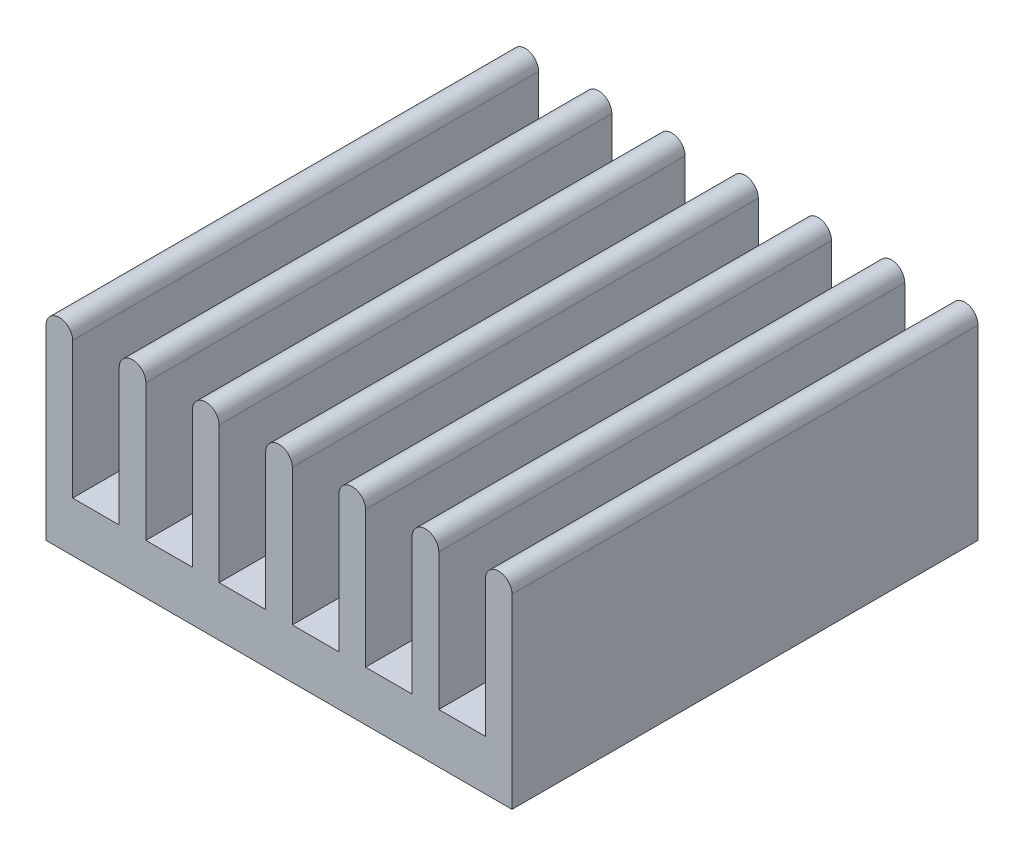
ISO-10303-21;
HEADER;
FILE_DESCRIPTION(('STEP AP214'),'2;1');
FILE_NAME('part.step','',(''),(''),'','','');
FILE_SCHEMA(('AUTOMOTIVE_DESIGN { 1 0 10303 214 1 1 1 1 }'));
ENDSEC;
DATA;
#1=APPLICATION_CONTEXT('core data for automotive mechanical design processes');
#2=APPLICATION_PROTOCOL_DEFINITION('international standard','automotive_design',2000,#1);
#3=PRODUCT_CONTEXT('',#1,'mechanical');
#4=PRODUCT('Part','Part','',(#3));
#5=PRODUCT_RELATED_PRODUCT_CATEGORY('part','',(#4));
#6=PRODUCT_DEFINITION_FORMATION('','',#4);
#7=PRODUCT_DEFINITION_CONTEXT('part definition',#1,'design');
#8=PRODUCT_DEFINITION('design','',#6,#7);
#9=PRODUCT_DEFINITION_SHAPE('','',#8);
#10=(LENGTH_UNIT() NAMED_UNIT(*) SI_UNIT(.MILLI.,.METRE.));
#11=(NAMED_UNIT(*) PLANE_ANGLE_UNIT() SI_UNIT($,.RADIAN.));
#12=(NAMED_UNIT(*) SI_UNIT($,.STERADIAN.) SOLID_ANGLE_UNIT());
#13=UNCERTAINTY_MEASURE_WITH_UNIT(LENGTH_MEASURE(1.E-05),#10,'distance_accuracy_value','');
#14=(GEOMETRIC_REPRESENTATION_CONTEXT(3) GLOBAL_UNCERTAINTY_ASSIGNED_CONTEXT((#13)) GLOBAL_UNIT_ASSIGNED_CONTEXT((#10,
#11,#12)) REPRESENTATION_CONTEXT('',''));
#15=CARTESIAN_POINT('',(0.,0.,0.));
#16=DIRECTION('',(0.,0.,1.));
#17=DIRECTION('',(1.,0.,0.));
#18=AXIS2_PLACEMENT_3D('',#15,#16,#17);
#19=CARTESIAN_POINT('',(-22.4999999999967,-6.44999999998326,3.25));
#20=DIRECTION('',(0.,-1.,0.));
#21=DIRECTION('',(-1.,0.,0.));
#22=AXIS2_PLACEMENT_3D('',#19,#20,#21);
#23=PLANE('',#22);
#24=DIRECTION('',(1.,0.,0.));
#25=VECTOR('',#24,1.);
#26=CARTESIAN_POINT('',(-22.4999999999967,-6.44999999998326,-3.75));
#27=LINE('',#26,#25);
#28=CARTESIAN_POINT('',(-22.4999999999967,-6.44999999998326,-3.75));
#29=VERTEX_POINT('',#28);
#30=CARTESIAN_POINT('',(-8.49999999999675,-6.44999999998326,-3.75));
#31=VERTEX_POINT('',#30);
#32=EDGE_CURVE('E11',#29,#31,#27,.T.);
#33=ORIENTED_EDGE('',*,*,#32,.T.);
#34=DIRECTION('',(0.,0.,-1.));
#35=VECTOR('',#34,1.);
#36=CARTESIAN_POINT('',(-8.49999999999675,-6.44999999998326,10.25));
#37=LINE('',#36,#35);
#38=CARTESIAN_POINT('',(-8.49999999999675,-6.44999999998326,10.25));
#39=VERTEX_POINT('',#38);
#40=EDGE_CURVE('E42',#39,#31,#37,.T.);
#41=ORIENTED_EDGE('',*,*,#40,.F.);
#42=DIRECTION('',(1.,0.,0.));
#43=VECTOR('',#42,1.);
#44=CARTESIAN_POINT('',(-22.4999999999967,-6.44999999998325,10.25));
#45=LINE('',#44,#43);
#46=CARTESIAN_POINT('',(-22.4999999999967,-6.44999999998325,10.25));
#47=VERTEX_POINT('',#46);
#48=EDGE_CURVE('E223',#47,#39,#45,.T.);
#49=ORIENTED_EDGE('',*,*,#48,.F.);
#50=DIRECTION('',(0.,0.,-1.));
#51=VECTOR('',#50,1.);
#52=CARTESIAN_POINT('',(-22.4999999999967,-6.44999999998325,10.25));
#53=LINE('',#52,#51);
#54=EDGE_CURVE('E28',#47,#29,#53,.T.);
#55=ORIENTED_EDGE('',*,*,#54,.T.);
#56=EDGE_LOOP('',(#33,#41,#49,#55));
#57=FACE_BOUND('',#56,.T.);
#58=ADVANCED_FACE('F17',(#57),#23,.T.);
#59=CARTESIAN_POINT('',(-15.4999999999967,-6.44999999998326,-3.75));
#60=DIRECTION('',(0.,0.,-1.));
#61=DIRECTION('',(0.,-1.,0.));
#62=AXIS2_PLACEMENT_3D('',#59,#60,#61);
#63=PLANE('',#62);
#64=CARTESIAN_POINT('',(-22.0999999999967,-0.849999999983262,-3.75));
#65=DIRECTION('',(0.,0.,1.));
#66=DIRECTION('',(-1.,0.,0.));
#67=AXIS2_PLACEMENT_3D('',#64,#65,#66);
#68=CIRCLE('',#67,0.4);
#69=CARTESIAN_POINT('',(-21.6999999999967,-0.849999999983261,-3.75));
#70=VERTEX_POINT('',#69);
#71=CARTESIAN_POINT('',(-22.4999999999967,-0.849999999983261,-3.75));
#72=VERTEX_POINT('',#71);
#73=EDGE_CURVE('E21',#70,#72,#68,.T.);
#74=ORIENTED_EDGE('',*,*,#73,.F.);
#75=DIRECTION('',(0.,1.,0.));
#76=VECTOR('',#75,1.);
#77=CARTESIAN_POINT('',(-21.6999999999967,-4.94999999998326,-3.75));
#78=LINE('',#77,#76);
#79=CARTESIAN_POINT('',(-21.6999999999967,-4.94999999998326,-3.75));
#80=VERTEX_POINT('',#79);
#81=EDGE_CURVE('E430',#80,#70,#78,.T.);
#82=ORIENTED_EDGE('',*,*,#81,.F.);
#83=DIRECTION('',(-1.,0.,0.));
#84=VECTOR('',#83,1.);
#85=CARTESIAN_POINT('',(-20.2999999999967,-4.94999999998325,-3.75));
#86=LINE('',#85,#84);
#87=CARTESIAN_POINT('',(-20.2999999999967,-4.94999999998324,-3.75));
#88=VERTEX_POINT('',#87);
#89=EDGE_CURVE('E494',#88,#80,#86,.T.);
#90=ORIENTED_EDGE('',*,*,#89,.F.);
#91=DIRECTION('',(0.,-1.,0.));
#92=VECTOR('',#91,1.);
#93=CARTESIAN_POINT('',(-20.2999999999967,-0.849999999983261,-3.75));
#94=LINE('',#93,#92);
#95=CARTESIAN_POINT('',(-20.2999999999967,-0.849999999983261,-3.75));
#96=VERTEX_POINT('',#95);
#97=EDGE_CURVE('E347',#96,#88,#94,.T.);
#98=ORIENTED_EDGE('',*,*,#97,.F.);
#99=CARTESIAN_POINT('',(-19.8999999999967,-0.849999999983264,-3.75));
#100=DIRECTION('',(0.,0.,1.));
#101=DIRECTION('',(-1.,0.,0.));
#102=AXIS2_PLACEMENT_3D('',#99,#100,#101);
#103=CIRCLE('',#102,0.4);
#104=CARTESIAN_POINT('',(-19.4999999999967,-0.849999999983261,-3.75));
#105=VERTEX_POINT('',#104);
#106=EDGE_CURVE('E346',#105,#96,#103,.T.);
#107=ORIENTED_EDGE('',*,*,#106,.F.);
#108=DIRECTION('',(0.,1.,0.));
#109=VECTOR('',#108,1.);
#110=CARTESIAN_POINT('',(-19.4999999999967,-4.94999999998326,-3.75));
#111=LINE('',#110,#109);
#112=CARTESIAN_POINT('',(-19.4999999999967,-4.94999999998326,-3.75));
#113=VERTEX_POINT('',#112);
#114=EDGE_CURVE('E336',#113,#105,#111,.T.);
#115=ORIENTED_EDGE('',*,*,#114,.F.);
#116=DIRECTION('',(-1.,0.,0.));
#117=VECTOR('',#116,1.);
#118=CARTESIAN_POINT('',(-18.0999999999967,-4.94999999998327,-3.75));
#119=LINE('',#118,#117);
#120=CARTESIAN_POINT('',(-18.0999999999967,-4.94999999998327,-3.75));
#121=VERTEX_POINT('',#120);
#122=EDGE_CURVE('E335',#121,#113,#119,.T.);
#123=ORIENTED_EDGE('',*,*,#122,.F.);
#124=DIRECTION('',(0.,-1.,0.));
#125=VECTOR('',#124,1.);
#126=CARTESIAN_POINT('',(-18.0999999999967,-0.849999999983261,-3.75));
#127=LINE('',#126,#125);
#128=CARTESIAN_POINT('',(-18.0999999999967,-0.849999999983261,-3.75));
#129=VERTEX_POINT('',#128);
#130=EDGE_CURVE('E411',#129,#121,#127,.T.);
#131=ORIENTED_EDGE('',*,*,#130,.F.);
#132=CARTESIAN_POINT('',(-17.6999999999967,-0.849999999983262,-3.75));
#133=DIRECTION('',(0.,0.,1.));
#134=DIRECTION('',(-1.,0.,0.));
#135=AXIS2_PLACEMENT_3D('',#132,#133,#134);
#136=CIRCLE('',#135,0.4);
#137=CARTESIAN_POINT('',(-17.2999999999967,-0.849999999983261,-3.75));
#138=VERTEX_POINT('',#137);
#139=EDGE_CURVE('E362',#138,#129,#136,.T.);
#140=ORIENTED_EDGE('',*,*,#139,.F.);
#141=DIRECTION('',(0.,1.,0.));
#142=VECTOR('',#141,1.);
#143=CARTESIAN_POINT('',(-17.2999999999967,-4.94999999998327,-3.75));
#144=LINE('',#143,#142);
#145=CARTESIAN_POINT('',(-17.2999999999967,-4.94999999998327,-3.75));
#146=VERTEX_POINT('',#145);
#147=EDGE_CURVE('E361',#146,#138,#144,.T.);
#148=ORIENTED_EDGE('',*,*,#147,.F.);
#149=DIRECTION('',(-1.,0.,0.));
#150=VECTOR('',#149,1.);
#151=CARTESIAN_POINT('',(-15.8999999999968,-4.94999999998327,-3.75));
#152=LINE('',#151,#150);
#153=CARTESIAN_POINT('',(-15.8999999999968,-4.94999999998327,-3.75));
#154=VERTEX_POINT('',#153);
#155=EDGE_CURVE('E379',#154,#146,#152,.T.);
#156=ORIENTED_EDGE('',*,*,#155,.F.);
#157=DIRECTION('',(0.,-1.,0.));
#158=VECTOR('',#157,1.);
#159=CARTESIAN_POINT('',(-15.8999999999967,-0.849999999983261,-3.75));
#160=LINE('',#159,#158);
#161=CARTESIAN_POINT('',(-15.8999999999967,-0.849999999983261,-3.75));
#162=VERTEX_POINT('',#161);
#163=EDGE_CURVE('E474',#162,#154,#160,.T.);
#164=ORIENTED_EDGE('',*,*,#163,.F.);
#165=CARTESIAN_POINT('',(-15.4999999999967,-0.849999999983262,-3.75));
#166=DIRECTION('',(0.,0.,1.));
#167=DIRECTION('',(-1.,0.,0.));
#168=AXIS2_PLACEMENT_3D('',#165,#166,#167);
#169=CIRCLE('',#168,0.4);
#170=CARTESIAN_POINT('',(-15.0999999999967,-0.849999999983261,-3.75));
#171=VERTEX_POINT('',#170);
#172=EDGE_CURVE('E458',#171,#162,#169,.T.);
#173=ORIENTED_EDGE('',*,*,#172,.F.);
#174=DIRECTION('',(0.,1.,0.));
#175=VECTOR('',#174,1.);
#176=CARTESIAN_POINT('',(-15.0999999999967,-4.94999999998326,-3.75));
#177=LINE('',#176,#175);
#178=CARTESIAN_POINT('',(-15.0999999999967,-4.94999999998326,-3.75));
#179=VERTEX_POINT('',#178);
#180=EDGE_CURVE('E472',#179,#171,#177,.T.);
#181=ORIENTED_EDGE('',*,*,#180,.F.);
#182=DIRECTION('',(-1.,0.,0.));
#183=VECTOR('',#182,1.);
#184=CARTESIAN_POINT('',(-13.6999999999967,-4.94999999998326,-3.75));
#185=LINE('',#184,#183);
#186=CARTESIAN_POINT('',(-13.6999999999967,-4.94999999998326,-3.75));
#187=VERTEX_POINT('',#186);
#188=EDGE_CURVE('E337',#187,#179,#185,.T.);
#189=ORIENTED_EDGE('',*,*,#188,.F.);
#190=DIRECTION('',(0.,-1.,0.));
#191=VECTOR('',#190,1.);
#192=CARTESIAN_POINT('',(-13.6999999999967,-0.849999999983261,-3.75));
#193=LINE('',#192,#191);
#194=CARTESIAN_POINT('',(-13.6999999999967,-0.849999999983261,-3.75));
#195=VERTEX_POINT('',#194);
#196=EDGE_CURVE('E304',#195,#187,#193,.T.);
#197=ORIENTED_EDGE('',*,*,#196,.F.);
#198=CARTESIAN_POINT('',(-13.2999999999967,-0.849999999983262,-3.75));
#199=DIRECTION('',(0.,0.,1.));
#200=DIRECTION('',(-1.,0.,0.));
#201=AXIS2_PLACEMENT_3D('',#198,#199,#200);
#202=CIRCLE('',#201,0.4);
#203=CARTESIAN_POINT('',(-12.8999999999967,-0.849999999983261,-3.75));
#204=VERTEX_POINT('',#203);
#205=EDGE_CURVE('E402',#204,#195,#202,.T.);
#206=ORIENTED_EDGE('',*,*,#205,.F.);
#207=DIRECTION('',(0.,1.,0.));
#208=VECTOR('',#207,1.);
#209=CARTESIAN_POINT('',(-12.8999999999967,-4.94999999998326,-3.75));
#210=LINE('',#209,#208);
#211=CARTESIAN_POINT('',(-12.8999999999967,-4.94999999998326,-3.75));
#212=VERTEX_POINT('',#211);
#213=EDGE_CURVE('E259',#212,#204,#210,.T.);
#214=ORIENTED_EDGE('',*,*,#213,.F.);
#215=DIRECTION('',(-1.,0.,0.));
#216=VECTOR('',#215,1.);
#217=CARTESIAN_POINT('',(-11.4999999999967,-4.94999999998326,-3.75));
#218=LINE('',#217,#216);
#219=CARTESIAN_POINT('',(-11.4999999999967,-4.94999999998326,-3.75));
#220=VERTEX_POINT('',#219);
#221=EDGE_CURVE('E252',#220,#212,#218,.T.);
#222=ORIENTED_EDGE('',*,*,#221,.F.);
#223=DIRECTION('',(0.,-1.,0.));
#224=VECTOR('',#223,1.);
#225=CARTESIAN_POINT('',(-11.4999999999967,-0.849999999983261,-3.75));
#226=LINE('',#225,#224);
#227=CARTESIAN_POINT('',(-11.4999999999967,-0.849999999983261,-3.75));
#228=VERTEX_POINT('',#227);
#229=EDGE_CURVE('E255',#228,#220,#226,.T.);
#230=ORIENTED_EDGE('',*,*,#229,.F.);
#231=CARTESIAN_POINT('',(-11.0999999999967,-0.849999999983261,-3.75));
#232=DIRECTION('',(0.,0.,1.));
#233=DIRECTION('',(-1.,0.,0.));
#234=AXIS2_PLACEMENT_3D('',#231,#232,#233);
#235=CIRCLE('',#234,0.4);
#236=CARTESIAN_POINT('',(-10.6999999999967,-0.849999999983261,-3.75));
#237=VERTEX_POINT('',#236);
#238=EDGE_CURVE('E325',#237,#228,#235,.T.);
#239=ORIENTED_EDGE('',*,*,#238,.F.);
#240=DIRECTION('',(0.,1.,0.));
#241=VECTOR('',#240,1.);
#242=CARTESIAN_POINT('',(-10.6999999999967,-4.94999999998327,-3.75));
#243=LINE('',#242,#241);
#244=CARTESIAN_POINT('',(-10.6999999999967,-4.94999999998327,-3.75));
#245=VERTEX_POINT('',#244);
#246=EDGE_CURVE('E310',#245,#237,#243,.T.);
#247=ORIENTED_EDGE('',*,*,#246,.F.);
#248=DIRECTION('',(-1.,0.,0.));
#249=VECTOR('',#248,1.);
#250=CARTESIAN_POINT('',(-9.29999999999674,-4.94999999998326,-3.75));
#251=LINE('',#250,#249);
#252=CARTESIAN_POINT('',(-9.29999999999674,-4.94999999998326,-3.75));
#253=VERTEX_POINT('',#252);
#254=EDGE_CURVE('E529',#253,#245,#251,.T.);
#255=ORIENTED_EDGE('',*,*,#254,.F.);
#256=DIRECTION('',(0.,-1.,0.));
#257=VECTOR('',#256,1.);
#258=CARTESIAN_POINT('',(-9.29999999999675,-0.849999999983261,-3.75));
#259=LINE('',#258,#257);
#260=CARTESIAN_POINT('',(-9.29999999999675,-0.849999999983261,-3.75));
#261=VERTEX_POINT('',#260);
#262=EDGE_CURVE('E351',#261,#253,#259,.T.);
#263=ORIENTED_EDGE('',*,*,#262,.F.);
#264=CARTESIAN_POINT('',(-8.89999999999675,-0.849999999983262,-3.75));
#265=DIRECTION('',(0.,0.,1.));
#266=DIRECTION('',(-1.,0.,0.));
#267=AXIS2_PLACEMENT_3D('',#264,#265,#266);
#268=CIRCLE('',#267,0.4);
#269=CARTESIAN_POINT('',(-8.49999999999675,-0.849999999983261,-3.75));
#270=VERTEX_POINT('',#269);
#271=EDGE_CURVE('E350',#270,#261,#268,.T.);
#272=ORIENTED_EDGE('',*,*,#271,.F.);
#273=DIRECTION('',(0.,1.,0.));
#274=VECTOR('',#273,1.);
#275=CARTESIAN_POINT('',(-8.49999999999675,-6.44999999998326,-3.75));
#276=LINE('',#275,#274);
#277=EDGE_CURVE('E397',#31,#270,#276,.T.);
#278=ORIENTED_EDGE('',*,*,#277,.F.);
#279=ORIENTED_EDGE('',*,*,#32,.F.);
#280=DIRECTION('',(0.,-1.,0.));
#281=VECTOR('',#280,1.);
#282=CARTESIAN_POINT('',(-22.4999999999967,-0.849999999983261,-3.75));
#283=LINE('',#282,#281);
#284=EDGE_CURVE('E431',#72,#29,#283,.T.);
#285=ORIENTED_EDGE('',*,*,#284,.F.);
#286=EDGE_LOOP('',(#74,#82,#90,#98,#107,#115,#123,#131,#140,#148,#156,#164,#173,#181,#189,#197,
#206,#214,#222,#230,#239,#247,#255,#263,#272,#278,#279,#285));
#287=FACE_BOUND('',#286,.T.);
#288=ADVANCED_FACE('F254',(#287),#63,.T.);
#289=CARTESIAN_POINT('',(-8.89999999999675,-0.849999999983262,3.25));
#290=DIRECTION('',(0.,0.,1.));
#291=DIRECTION('',(1.,0.,0.));
#292=AXIS2_PLACEMENT_3D('',#289,#290,#291);
#293=CYLINDRICAL_SURFACE('',#292,0.4);
#294=ORIENTED_EDGE('',*,*,#271,.T.);
#295=DIRECTION('',(0.,0.,-1.));
#296=VECTOR('',#295,1.);
#297=CARTESIAN_POINT('',(-9.29999999999675,-0.849999999983265,10.25));
#298=LINE('',#297,#296);
#299=CARTESIAN_POINT('',(-9.29999999999675,-0.849999999983257,10.25));
#300=VERTEX_POINT('',#299);
#301=EDGE_CURVE('E356',#300,#261,#298,.T.);
#302=ORIENTED_EDGE('',*,*,#301,.F.);
#303=CARTESIAN_POINT('',(-8.89999999999675,-0.849999999983259,10.25));
#304=DIRECTION('',(0.,0.,1.));
#305=DIRECTION('',(-1.,0.,0.));
#306=AXIS2_PLACEMENT_3D('',#303,#304,#305);
#307=CIRCLE('',#306,0.4);
#308=CARTESIAN_POINT('',(-8.49999999999675,-0.849999999983257,10.25));
#309=VERTEX_POINT('',#308);
#310=EDGE_CURVE('E296',#309,#300,#307,.T.);
#311=ORIENTED_EDGE('',*,*,#310,.F.);
#312=DIRECTION('',(0.,0.,-1.));
#313=VECTOR('',#312,1.);
#314=CARTESIAN_POINT('',(-8.49999999999675,-0.849999999983261,10.25));
#315=LINE('',#314,#313);
#316=EDGE_CURVE('E355',#309,#270,#315,.T.);
#317=ORIENTED_EDGE('',*,*,#316,.T.);
#318=EDGE_LOOP('',(#294,#302,#311,#317));
#319=FACE_BOUND('',#318,.T.);
#320=ADVANCED_FACE('F632',(#319),#293,.T.);
#321=CARTESIAN_POINT('',(-9.29999999999675,-0.849999999983265,3.25));
#322=DIRECTION('',(-1.,0.,0.));
#323=DIRECTION('',(0.,1.,0.));
#324=AXIS2_PLACEMENT_3D('',#321,#322,#323);
#325=PLANE('',#324);
#326=ORIENTED_EDGE('',*,*,#262,.T.);
#327=DIRECTION('',(0.,0.,-1.));
#328=VECTOR('',#327,1.);
#329=CARTESIAN_POINT('',(-9.29999999999674,-4.94999999998326,10.25));
#330=LINE('',#329,#328);
#331=CARTESIAN_POINT('',(-9.29999999999674,-4.94999999998326,10.25));
#332=VERTEX_POINT('',#331);
#333=EDGE_CURVE('E314',#332,#253,#330,.T.);
#334=ORIENTED_EDGE('',*,*,#333,.F.);
#335=DIRECTION('',(0.,-1.,0.));
#336=VECTOR('',#335,1.);
#337=CARTESIAN_POINT('',(-9.29999999999675,-0.849999999983261,10.25));
#338=LINE('',#337,#336);
#339=EDGE_CURVE('E293',#300,#332,#338,.T.);
#340=ORIENTED_EDGE('',*,*,#339,.F.);
#341=ORIENTED_EDGE('',*,*,#301,.T.);
#342=EDGE_LOOP('',(#326,#334,#340,#341));
#343=FACE_BOUND('',#342,.T.);
#344=ADVANCED_FACE('F641',(#343),#325,.T.);
#345=CARTESIAN_POINT('',(-9.29999999999674,-4.94999999998326,3.25));
#346=DIRECTION('',(0.,1.,0.));
#347=DIRECTION('',(1.,0.,0.));
#348=AXIS2_PLACEMENT_3D('',#345,#346,#347);
#349=PLANE('',#348);
#350=ORIENTED_EDGE('',*,*,#254,.T.);
#351=DIRECTION('',(0.,0.,-1.));
#352=VECTOR('',#351,1.);
#353=CARTESIAN_POINT('',(-10.6999999999967,-4.94999999998327,10.25));
#354=LINE('',#353,#352);
#355=CARTESIAN_POINT('',(-10.6999999999967,-4.94999999998327,10.25));
#356=VERTEX_POINT('',#355);
#357=EDGE_CURVE('E315',#356,#245,#354,.T.);
#358=ORIENTED_EDGE('',*,*,#357,.F.);
#359=DIRECTION('',(-1.,0.,0.));
#360=VECTOR('',#359,1.);
#361=CARTESIAN_POINT('',(-9.29999999999674,-4.94999999998326,10.25));
#362=LINE('',#361,#360);
#363=EDGE_CURVE('E297',#332,#356,#362,.T.);
#364=ORIENTED_EDGE('',*,*,#363,.F.);
#365=ORIENTED_EDGE('',*,*,#333,.T.);
#366=EDGE_LOOP('',(#350,#358,#364,#365));
#367=FACE_BOUND('',#366,.T.);
#368=ADVANCED_FACE('F637',(#367),#349,.T.);
#369=CARTESIAN_POINT('',(-10.6999999999967,-4.94999999998327,3.25));
#370=DIRECTION('',(1.,0.,0.));
#371=DIRECTION('',(0.,1.,0.));
#372=AXIS2_PLACEMENT_3D('',#369,#370,#371);
#373=PLANE('',#372);
#374=ORIENTED_EDGE('',*,*,#246,.T.);
#375=DIRECTION('',(0.,0.,-1.));
#376=VECTOR('',#375,1.);
#377=CARTESIAN_POINT('',(-10.6999999999967,-0.849999999983261,10.25));
#378=LINE('',#377,#376);
#379=CARTESIAN_POINT('',(-10.6999999999967,-0.849999999983257,10.25));
#380=VERTEX_POINT('',#379);
#381=EDGE_CURVE('E275',#380,#237,#378,.T.);
#382=ORIENTED_EDGE('',*,*,#381,.F.);
#383=DIRECTION('',(0.,1.,0.));
#384=VECTOR('',#383,1.);
#385=CARTESIAN_POINT('',(-10.6999999999967,-4.94999999998327,10.25));
#386=LINE('',#385,#384);
#387=EDGE_CURVE('E328',#356,#380,#386,.T.);
#388=ORIENTED_EDGE('',*,*,#387,.F.);
#389=ORIENTED_EDGE('',*,*,#357,.T.);
#390=EDGE_LOOP('',(#374,#382,#388,#389));
#391=FACE_BOUND('',#390,.T.);
#392=ADVANCED_FACE('F640',(#391),#373,.T.);
#393=CARTESIAN_POINT('',(-11.0999999999967,-0.84999999998326,3.25));
#394=DIRECTION('',(0.,0.,1.));
#395=DIRECTION('',(1.,0.,0.));
#396=AXIS2_PLACEMENT_3D('',#393,#394,#395);
#397=CYLINDRICAL_SURFACE('',#396,0.4);
#398=ORIENTED_EDGE('',*,*,#238,.T.);
#399=DIRECTION('',(0.,0.,-1.));
#400=VECTOR('',#399,1.);
#401=CARTESIAN_POINT('',(-11.4999999999967,-0.849999999983265,10.25));
#402=LINE('',#401,#400);
#403=CARTESIAN_POINT('',(-11.4999999999967,-0.849999999983257,10.25));
#404=VERTEX_POINT('',#403);
#405=EDGE_CURVE('E265',#404,#228,#402,.T.);
#406=ORIENTED_EDGE('',*,*,#405,.F.);
#407=CARTESIAN_POINT('',(-11.0999999999967,-0.849999999983258,10.25));
#408=DIRECTION('',(0.,0.,1.));
#409=DIRECTION('',(-1.,0.,0.));
#410=AXIS2_PLACEMENT_3D('',#407,#408,#409);
#411=CIRCLE('',#410,0.4);
#412=EDGE_CURVE('E320',#380,#404,#411,.T.);
#413=ORIENTED_EDGE('',*,*,#412,.F.);
#414=ORIENTED_EDGE('',*,*,#381,.T.);
#415=EDGE_LOOP('',(#398,#406,#413,#414));
#416=FACE_BOUND('',#415,.T.);
#417=ADVANCED_FACE('F671',(#416),#397,.T.);
#418=CARTESIAN_POINT('',(-11.4999999999967,-0.849999999983265,3.25));
#419=DIRECTION('',(-1.,0.,0.));
#420=DIRECTION('',(0.,0.,1.));
#421=AXIS2_PLACEMENT_3D('',#418,#419,#420);
#422=PLANE('',#421);
#423=ORIENTED_EDGE('',*,*,#229,.T.);
#424=DIRECTION('',(0.,0.,-1.));
#425=VECTOR('',#424,1.);
#426=CARTESIAN_POINT('',(-11.4999999999967,-4.94999999998326,10.25));
#427=LINE('',#426,#425);
#428=CARTESIAN_POINT('',(-11.4999999999967,-4.94999999998326,10.25));
#429=VERTEX_POINT('',#428);
#430=EDGE_CURVE('E266',#429,#220,#427,.T.);
#431=ORIENTED_EDGE('',*,*,#430,.F.);
#432=DIRECTION('',(0.,-1.,0.));
#433=VECTOR('',#432,1.);
#434=CARTESIAN_POINT('',(-11.4999999999967,-0.849999999983261,10.25));
#435=LINE('',#434,#433);
#436=EDGE_CURVE('E316',#404,#429,#435,.T.);
#437=ORIENTED_EDGE('',*,*,#436,.F.);
#438=ORIENTED_EDGE('',*,*,#405,.T.);
#439=EDGE_LOOP('',(#423,#431,#437,#438));
#440=FACE_BOUND('',#439,.T.);
#441=ADVANCED_FACE('F19',(#440),#422,.T.);
#442=CARTESIAN_POINT('',(-11.4999999999967,-4.94999999998326,3.25));
#443=DIRECTION('',(0.,1.,0.));
#444=DIRECTION('',(1.,0.,0.));
#445=AXIS2_PLACEMENT_3D('',#442,#443,#444);
#446=PLANE('',#445);
#447=ORIENTED_EDGE('',*,*,#221,.T.);
#448=DIRECTION('',(0.,0.,-1.));
#449=VECTOR('',#448,1.);
#450=CARTESIAN_POINT('',(-12.8999999999967,-4.94999999998326,10.25));
#451=LINE('',#450,#449);
#452=CARTESIAN_POINT('',(-12.8999999999967,-4.94999999998326,10.25));
#453=VERTEX_POINT('',#452);
#454=EDGE_CURVE('E285',#453,#212,#451,.T.);
#455=ORIENTED_EDGE('',*,*,#454,.F.);
#456=DIRECTION('',(-1.,0.,0.));
#457=VECTOR('',#456,1.);
#458=CARTESIAN_POINT('',(-11.4999999999967,-4.94999999998326,10.25));
#459=LINE('',#458,#457);
#460=EDGE_CURVE('E278',#429,#453,#459,.T.);
#461=ORIENTED_EDGE('',*,*,#460,.F.);
#462=ORIENTED_EDGE('',*,*,#430,.T.);
#463=EDGE_LOOP('',(#447,#455,#461,#462));
#464=FACE_BOUND('',#463,.T.);
#465=ADVANCED_FACE('F277',(#464),#446,.T.);
#466=CARTESIAN_POINT('',(-12.8999999999967,-4.94999999998326,3.25));
#467=DIRECTION('',(1.,0.,0.));
#468=DIRECTION('',(0.,1.,0.));
#469=AXIS2_PLACEMENT_3D('',#466,#467,#468);
#470=PLANE('',#469);
#471=ORIENTED_EDGE('',*,*,#213,.T.);
#472=DIRECTION('',(0.,0.,-1.));
#473=VECTOR('',#472,1.);
#474=CARTESIAN_POINT('',(-12.8999999999967,-0.849999999983261,10.25));
#475=LINE('',#474,#473);
#476=CARTESIAN_POINT('',(-12.8999999999967,-0.849999999983257,10.25));
#477=VERTEX_POINT('',#476);
#478=EDGE_CURVE('E308',#477,#204,#475,.T.);
#479=ORIENTED_EDGE('',*,*,#478,.F.);
#480=DIRECTION('',(0.,1.,0.));
#481=VECTOR('',#480,1.);
#482=CARTESIAN_POINT('',(-12.8999999999967,-4.94999999998326,10.25));
#483=LINE('',#482,#481);
#484=EDGE_CURVE('E403',#453,#477,#483,.T.);
#485=ORIENTED_EDGE('',*,*,#484,.F.);
#486=ORIENTED_EDGE('',*,*,#454,.T.);
#487=EDGE_LOOP('',(#471,#479,#485,#486));
#488=FACE_BOUND('',#487,.T.);
#489=ADVANCED_FACE('F615',(#488),#470,.T.);
#490=CARTESIAN_POINT('',(-13.2999999999967,-0.849999999983261,3.25));
#491=DIRECTION('',(0.,0.,1.));
#492=DIRECTION('',(1.,0.,0.));
#493=AXIS2_PLACEMENT_3D('',#490,#491,#492);
#494=CYLINDRICAL_SURFACE('',#493,0.4);
#495=ORIENTED_EDGE('',*,*,#205,.T.);
#496=DIRECTION('',(0.,0.,-1.));
#497=VECTOR('',#496,1.);
#498=CARTESIAN_POINT('',(-13.6999999999967,-0.849999999983265,10.25));
#499=LINE('',#498,#497);
#500=CARTESIAN_POINT('',(-13.6999999999967,-0.849999999983257,10.25));
#501=VERTEX_POINT('',#500);
#502=EDGE_CURVE('E309',#501,#195,#499,.T.);
#503=ORIENTED_EDGE('',*,*,#502,.F.);
#504=CARTESIAN_POINT('',(-13.2999999999967,-0.849999999983259,10.25));
#505=DIRECTION('',(0.,0.,1.));
#506=DIRECTION('',(-1.,0.,0.));
#507=AXIS2_PLACEMENT_3D('',#504,#505,#506);
#508=CIRCLE('',#507,0.4);
#509=EDGE_CURVE('E302',#477,#501,#508,.T.);
#510=ORIENTED_EDGE('',*,*,#509,.F.);
#511=ORIENTED_EDGE('',*,*,#478,.T.);
#512=EDGE_LOOP('',(#495,#503,#510,#511));
#513=FACE_BOUND('',#512,.T.);
#514=ADVANCED_FACE('F613',(#513),#494,.T.);
#515=CARTESIAN_POINT('',(-13.6999999999967,-0.849999999983265,3.25));
#516=DIRECTION('',(-1.,0.,0.));
#517=DIRECTION('',(0.,0.,1.));
#518=AXIS2_PLACEMENT_3D('',#515,#516,#517);
#519=PLANE('',#518);
#520=ORIENTED_EDGE('',*,*,#196,.T.);
#521=DIRECTION('',(0.,0.,-1.));
#522=VECTOR('',#521,1.);
#523=CARTESIAN_POINT('',(-13.6999999999967,-4.94999999998326,10.25));
#524=LINE('',#523,#522);
#525=CARTESIAN_POINT('',(-13.6999999999967,-4.94999999998326,10.25));
#526=VERTEX_POINT('',#525);
#527=EDGE_CURVE('E341',#526,#187,#524,.T.);
#528=ORIENTED_EDGE('',*,*,#527,.F.);
#529=DIRECTION('',(0.,-1.,0.));
#530=VECTOR('',#529,1.);
#531=CARTESIAN_POINT('',(-13.6999999999967,-0.849999999983261,10.25));
#532=LINE('',#531,#530);
#533=EDGE_CURVE('E298',#501,#526,#532,.T.);
#534=ORIENTED_EDGE('',*,*,#533,.F.);
#535=ORIENTED_EDGE('',*,*,#502,.T.);
#536=EDGE_LOOP('',(#520,#528,#534,#535));
#537=FACE_BOUND('',#536,.T.);
#538=ADVANCED_FACE('F608',(#537),#519,.T.);
#539=CARTESIAN_POINT('',(-13.6999999999967,-4.94999999998326,3.25));
#540=DIRECTION('',(0.,1.,0.));
#541=DIRECTION('',(1.,0.,0.));
#542=AXIS2_PLACEMENT_3D('',#539,#540,#541);
#543=PLANE('',#542);
#544=ORIENTED_EDGE('',*,*,#188,.T.);
#545=DIRECTION('',(0.,0.,-1.));
#546=VECTOR('',#545,1.);
#547=CARTESIAN_POINT('',(-15.0999999999967,-4.94999999998326,10.25));
#548=LINE('',#547,#546);
#549=CARTESIAN_POINT('',(-15.0999999999967,-4.94999999998326,10.25));
#550=VERTEX_POINT('',#549);
#551=EDGE_CURVE('E461',#550,#179,#548,.T.);
#552=ORIENTED_EDGE('',*,*,#551,.F.);
#553=DIRECTION('',(-1.,0.,0.));
#554=VECTOR('',#553,1.);
#555=CARTESIAN_POINT('',(-13.6999999999967,-4.94999999998326,10.25));
#556=LINE('',#555,#554);
#557=EDGE_CURVE('E303',#526,#550,#556,.T.);
#558=ORIENTED_EDGE('',*,*,#557,.F.);
#559=ORIENTED_EDGE('',*,*,#527,.T.);
#560=EDGE_LOOP('',(#544,#552,#558,#559));
#561=FACE_BOUND('',#560,.T.);
#562=ADVANCED_FACE('F604',(#561),#543,.T.);
#563=CARTESIAN_POINT('',(-15.0999999999967,-4.94999999998326,3.25));
#564=DIRECTION('',(1.,0.,0.));
#565=DIRECTION('',(0.,1.,0.));
#566=AXIS2_PLACEMENT_3D('',#563,#564,#565);
#567=PLANE('',#566);
#568=ORIENTED_EDGE('',*,*,#180,.T.);
#569=DIRECTION('',(0.,0.,-1.));
#570=VECTOR('',#569,1.);
#571=CARTESIAN_POINT('',(-15.0999999999967,-0.849999999983261,10.25));
#572=LINE('',#571,#570);
#573=CARTESIAN_POINT('',(-15.0999999999967,-0.849999999983257,10.25));
#574=VERTEX_POINT('',#573);
#575=EDGE_CURVE('E462',#574,#171,#572,.T.);
#576=ORIENTED_EDGE('',*,*,#575,.F.);
#577=DIRECTION('',(0.,1.,0.));
#578=VECTOR('',#577,1.);
#579=CARTESIAN_POINT('',(-15.0999999999967,-4.94999999998326,10.25));
#580=LINE('',#579,#578);
#581=EDGE_CURVE('E381',#550,#574,#580,.T.);
#582=ORIENTED_EDGE('',*,*,#581,.F.);
#583=ORIENTED_EDGE('',*,*,#551,.T.);
#584=EDGE_LOOP('',(#568,#576,#582,#583));
#585=FACE_BOUND('',#584,.T.);
#586=ADVANCED_FACE('F601',(#585),#567,.T.);
#587=CARTESIAN_POINT('',(-15.4999999999967,-0.849999999983261,3.25));
#588=DIRECTION('',(0.,0.,1.));
#589=DIRECTION('',(1.,0.,0.));
#590=AXIS2_PLACEMENT_3D('',#587,#588,#589);
#591=CYLINDRICAL_SURFACE('',#590,0.400000000000005);
#592=ORIENTED_EDGE('',*,*,#172,.T.);
#593=DIRECTION('',(0.,0.,-1.));
#594=VECTOR('',#593,1.);
#595=CARTESIAN_POINT('',(-15.8999999999967,-0.849999999983265,10.25));
#596=LINE('',#595,#594);
#597=CARTESIAN_POINT('',(-15.8999999999967,-0.849999999983257,10.25));
#598=VERTEX_POINT('',#597);
#599=EDGE_CURVE('E482',#598,#162,#596,.T.);
#600=ORIENTED_EDGE('',*,*,#599,.F.);
#601=CARTESIAN_POINT('',(-15.4999999999967,-0.849999999983259,10.25));
#602=DIRECTION('',(0.,0.,1.));
#603=DIRECTION('',(-1.,0.,0.));
#604=AXIS2_PLACEMENT_3D('',#601,#602,#603);
#605=CIRCLE('',#604,0.4);
#606=EDGE_CURVE('E384',#574,#598,#605,.T.);
#607=ORIENTED_EDGE('',*,*,#606,.F.);
#608=ORIENTED_EDGE('',*,*,#575,.T.);
#609=EDGE_LOOP('',(#592,#600,#607,#608));
#610=FACE_BOUND('',#609,.T.);
#611=ADVANCED_FACE('F596',(#610),#591,.T.);
#612=CARTESIAN_POINT('',(-15.8999999999967,-0.849999999983265,3.25));
#613=DIRECTION('',(-1.,0.,0.));
#614=DIRECTION('',(0.,0.,1.));
#615=AXIS2_PLACEMENT_3D('',#612,#613,#614);
#616=PLANE('',#615);
#617=ORIENTED_EDGE('',*,*,#163,.T.);
#618=DIRECTION('',(0.,0.,-1.));
#619=VECTOR('',#618,1.);
#620=CARTESIAN_POINT('',(-15.8999999999968,-4.94999999998327,10.25));
#621=LINE('',#620,#619);
#622=CARTESIAN_POINT('',(-15.8999999999968,-4.94999999998327,10.25));
#623=VERTEX_POINT('',#622);
#624=EDGE_CURVE('E566',#623,#154,#621,.T.);
#625=ORIENTED_EDGE('',*,*,#624,.F.);
#626=DIRECTION('',(0.,-1.,0.));
#627=VECTOR('',#626,1.);
#628=CARTESIAN_POINT('',(-15.8999999999967,-0.849999999983261,10.25));
#629=LINE('',#628,#627);
#630=EDGE_CURVE('E448',#598,#623,#629,.T.);
#631=ORIENTED_EDGE('',*,*,#630,.F.);
#632=ORIENTED_EDGE('',*,*,#599,.T.);
#633=EDGE_LOOP('',(#617,#625,#631,#632));
#634=FACE_BOUND('',#633,.T.);
#635=ADVANCED_FACE('F595',(#634),#616,.T.);
#636=CARTESIAN_POINT('',(-15.8999999999968,-4.94999999998327,3.25));
#637=DIRECTION('',(0.,1.,0.));
#638=DIRECTION('',(1.,0.,0.));
#639=AXIS2_PLACEMENT_3D('',#636,#637,#638);
#640=PLANE('',#639);
#641=ORIENTED_EDGE('',*,*,#155,.T.);
#642=DIRECTION('',(0.,0.,-1.));
#643=VECTOR('',#642,1.);
#644=CARTESIAN_POINT('',(-17.2999999999967,-4.94999999998327,10.25));
#645=LINE('',#644,#643);
#646=CARTESIAN_POINT('',(-17.2999999999967,-4.94999999998327,10.25));
#647=VERTEX_POINT('',#646);
#648=EDGE_CURVE('E357',#647,#146,#645,.T.);
#649=ORIENTED_EDGE('',*,*,#648,.F.);
#650=DIRECTION('',(-1.,0.,0.));
#651=VECTOR('',#650,1.);
#652=CARTESIAN_POINT('',(-15.8999999999968,-4.94999999998327,10.25));
#653=LINE('',#652,#651);
#654=EDGE_CURVE('E415',#623,#647,#653,.T.);
#655=ORIENTED_EDGE('',*,*,#654,.F.);
#656=ORIENTED_EDGE('',*,*,#624,.T.);
#657=EDGE_LOOP('',(#641,#649,#655,#656));
#658=FACE_BOUND('',#657,.T.);
#659=ADVANCED_FACE('F593',(#658),#640,.T.);
#660=CARTESIAN_POINT('',(-17.2999999999967,-4.94999999998327,3.25));
#661=DIRECTION('',(1.,0.,0.));
#662=DIRECTION('',(0.,1.,0.));
#663=AXIS2_PLACEMENT_3D('',#660,#661,#662);
#664=PLANE('',#663);
#665=ORIENTED_EDGE('',*,*,#147,.T.);
#666=DIRECTION('',(0.,0.,-1.));
#667=VECTOR('',#666,1.);
#668=CARTESIAN_POINT('',(-17.2999999999967,-0.849999999983261,10.25));
#669=LINE('',#668,#667);
#670=CARTESIAN_POINT('',(-17.2999999999967,-0.849999999983257,10.25));
#671=VERTEX_POINT('',#670);
#672=EDGE_CURVE('E391',#671,#138,#669,.T.);
#673=ORIENTED_EDGE('',*,*,#672,.F.);
#674=DIRECTION('',(0.,1.,0.));
#675=VECTOR('',#674,1.);
#676=CARTESIAN_POINT('',(-17.2999999999967,-4.94999999998327,10.25));
#677=LINE('',#676,#675);
#678=EDGE_CURVE('E412',#647,#671,#677,.T.);
#679=ORIENTED_EDGE('',*,*,#678,.F.);
#680=ORIENTED_EDGE('',*,*,#648,.T.);
#681=EDGE_LOOP('',(#665,#673,#679,#680));
#682=FACE_BOUND('',#681,.T.);
#683=ADVANCED_FACE('F582',(#682),#664,.T.);
#684=CARTESIAN_POINT('',(-17.6999999999967,-0.84999999998326,3.25));
#685=DIRECTION('',(0.,0.,1.));
#686=DIRECTION('',(1.,0.,0.));
#687=AXIS2_PLACEMENT_3D('',#684,#685,#686);
#688=CYLINDRICAL_SURFACE('',#687,0.4);
#689=ORIENTED_EDGE('',*,*,#139,.T.);
#690=DIRECTION('',(0.,0.,-1.));
#691=VECTOR('',#690,1.);
#692=CARTESIAN_POINT('',(-18.0999999999967,-0.849999999983265,10.25));
#693=LINE('',#692,#691);
#694=CARTESIAN_POINT('',(-18.0999999999967,-0.849999999983257,10.25));
#695=VERTEX_POINT('',#694);
#696=EDGE_CURVE('E422',#695,#129,#693,.T.);
#697=ORIENTED_EDGE('',*,*,#696,.F.);
#698=CARTESIAN_POINT('',(-17.6999999999967,-0.849999999983259,10.25));
#699=DIRECTION('',(0.,0.,1.));
#700=DIRECTION('',(-1.,0.,0.));
#701=AXIS2_PLACEMENT_3D('',#698,#699,#700);
#702=CIRCLE('',#701,0.4);
#703=EDGE_CURVE('E291',#671,#695,#702,.T.);
#704=ORIENTED_EDGE('',*,*,#703,.F.);
#705=ORIENTED_EDGE('',*,*,#672,.T.);
#706=EDGE_LOOP('',(#689,#697,#704,#705));
#707=FACE_BOUND('',#706,.T.);
#708=ADVANCED_FACE('F587',(#707),#688,.T.);
#709=CARTESIAN_POINT('',(-18.0999999999967,-0.849999999983265,3.25));
#710=DIRECTION('',(-1.,0.,0.));
#711=DIRECTION('',(0.,0.,1.));
#712=AXIS2_PLACEMENT_3D('',#709,#710,#711);
#713=PLANE('',#712);
#714=ORIENTED_EDGE('',*,*,#130,.T.);
#715=DIRECTION('',(0.,0.,-1.));
#716=VECTOR('',#715,1.);
#717=CARTESIAN_POINT('',(-18.0999999999967,-4.94999999998327,10.25));
#718=LINE('',#717,#716);
#719=CARTESIAN_POINT('',(-18.0999999999967,-4.94999999998327,10.25));
#720=VERTEX_POINT('',#719);
#721=EDGE_CURVE('E331',#720,#121,#718,.T.);
#722=ORIENTED_EDGE('',*,*,#721,.F.);
#723=DIRECTION('',(0.,-1.,0.));
#724=VECTOR('',#723,1.);
#725=CARTESIAN_POINT('',(-18.0999999999967,-0.849999999983261,10.25));
#726=LINE('',#725,#724);
#727=EDGE_CURVE('E288',#695,#720,#726,.T.);
#728=ORIENTED_EDGE('',*,*,#727,.F.);
#729=ORIENTED_EDGE('',*,*,#696,.T.);
#730=EDGE_LOOP('',(#714,#722,#728,#729));
#731=FACE_BOUND('',#730,.T.);
#732=ADVANCED_FACE('F662',(#731),#713,.T.);
#733=CARTESIAN_POINT('',(-18.0999999999967,-4.94999999998327,3.25));
#734=DIRECTION('',(0.,1.,0.));
#735=DIRECTION('',(1.,0.,0.));
#736=AXIS2_PLACEMENT_3D('',#733,#734,#735);
#737=PLANE('',#736);
#738=ORIENTED_EDGE('',*,*,#122,.T.);
#739=DIRECTION('',(0.,0.,-1.));
#740=VECTOR('',#739,1.);
#741=CARTESIAN_POINT('',(-19.4999999999967,-4.94999999998326,10.25));
#742=LINE('',#741,#740);
#743=CARTESIAN_POINT('',(-19.4999999999967,-4.94999999998326,10.25));
#744=VERTEX_POINT('',#743);
#745=EDGE_CURVE('E456',#744,#113,#742,.T.);
#746=ORIENTED_EDGE('',*,*,#745,.F.);
#747=DIRECTION('',(-1.,0.,0.));
#748=VECTOR('',#747,1.);
#749=CARTESIAN_POINT('',(-18.0999999999967,-4.94999999998327,10.25));
#750=LINE('',#749,#748);
#751=EDGE_CURVE('E292',#720,#744,#750,.T.);
#752=ORIENTED_EDGE('',*,*,#751,.F.);
#753=ORIENTED_EDGE('',*,*,#721,.T.);
#754=EDGE_LOOP('',(#738,#746,#752,#753));
#755=FACE_BOUND('',#754,.T.);
#756=ADVANCED_FACE('F658',(#755),#737,.T.);
#757=CARTESIAN_POINT('',(-19.4999999999967,-4.94999999998326,3.25));
#758=DIRECTION('',(1.,0.,0.));
#759=DIRECTION('',(0.,1.,0.));
#760=AXIS2_PLACEMENT_3D('',#757,#758,#759);
#761=PLANE('',#760);
#762=ORIENTED_EDGE('',*,*,#114,.T.);
#763=DIRECTION('',(0.,0.,-1.));
#764=VECTOR('',#763,1.);
#765=CARTESIAN_POINT('',(-19.4999999999967,-0.849999999983261,10.25));
#766=LINE('',#765,#764);
#767=CARTESIAN_POINT('',(-19.4999999999967,-0.849999999983257,10.25));
#768=VERTEX_POINT('',#767);
#769=EDGE_CURVE('E342',#768,#105,#766,.T.);
#770=ORIENTED_EDGE('',*,*,#769,.F.);
#771=DIRECTION('',(0.,1.,0.));
#772=VECTOR('',#771,1.);
#773=CARTESIAN_POINT('',(-19.4999999999967,-4.94999999998326,10.25));
#774=LINE('',#773,#772);
#775=EDGE_CURVE('E321',#744,#768,#774,.T.);
#776=ORIENTED_EDGE('',*,*,#775,.F.);
#777=ORIENTED_EDGE('',*,*,#745,.T.);
#778=EDGE_LOOP('',(#762,#770,#776,#777));
#779=FACE_BOUND('',#778,.T.);
#780=ADVANCED_FACE('F661',(#779),#761,.T.);
#781=CARTESIAN_POINT('',(-19.8999999999967,-0.849999999983263,3.25));
#782=DIRECTION('',(0.,0.,1.));
#783=DIRECTION('',(1.,0.,0.));
#784=AXIS2_PLACEMENT_3D('',#781,#782,#783);
#785=CYLINDRICAL_SURFACE('',#784,0.400000000000005);
#786=ORIENTED_EDGE('',*,*,#106,.T.);
#787=DIRECTION('',(0.,0.,-1.));
#788=VECTOR('',#787,1.);
#789=CARTESIAN_POINT('',(-20.2999999999967,-0.84999999998325,10.25));
#790=LINE('',#789,#788);
#791=CARTESIAN_POINT('',(-20.2999999999967,-0.849999999983257,10.25));
#792=VERTEX_POINT('',#791);
#793=EDGE_CURVE('E490',#792,#96,#790,.T.);
#794=ORIENTED_EDGE('',*,*,#793,.F.);
#795=CARTESIAN_POINT('',(-19.8999999999967,-0.849999999983261,10.25));
#796=DIRECTION('',(0.,0.,1.));
#797=DIRECTION('',(-1.,0.,0.));
#798=AXIS2_PLACEMENT_3D('',#795,#796,#797);
#799=CIRCLE('',#798,0.4);
#800=EDGE_CURVE('E324',#768,#792,#799,.T.);
#801=ORIENTED_EDGE('',*,*,#800,.F.);
#802=ORIENTED_EDGE('',*,*,#769,.T.);
#803=EDGE_LOOP('',(#786,#794,#801,#802));
#804=FACE_BOUND('',#803,.T.);
#805=ADVANCED_FACE('F647',(#804),#785,.T.);
#806=CARTESIAN_POINT('',(-20.2999999999967,-0.84999999998325,3.25));
#807=DIRECTION('',(-1.,0.,0.));
#808=DIRECTION('',(0.,0.,1.));
#809=AXIS2_PLACEMENT_3D('',#806,#807,#808);
#810=PLANE('',#809);
#811=ORIENTED_EDGE('',*,*,#97,.T.);
#812=DIRECTION('',(0.,0.,-1.));
#813=VECTOR('',#812,1.);
#814=CARTESIAN_POINT('',(-20.2999999999967,-4.94999999998324,10.25));
#815=LINE('',#814,#813);
#816=CARTESIAN_POINT('',(-20.2999999999967,-4.94999999998324,10.25));
#817=VERTEX_POINT('',#816);
#818=EDGE_CURVE('E442',#817,#88,#815,.T.);
#819=ORIENTED_EDGE('',*,*,#818,.F.);
#820=DIRECTION('',(0.,-1.,0.));
#821=VECTOR('',#820,1.);
#822=CARTESIAN_POINT('',(-20.2999999999967,-0.849999999983261,10.25));
#823=LINE('',#822,#821);
#824=EDGE_CURVE('E512',#792,#817,#823,.T.);
#825=ORIENTED_EDGE('',*,*,#824,.F.);
#826=ORIENTED_EDGE('',*,*,#793,.T.);
#827=EDGE_LOOP('',(#811,#819,#825,#826));
#828=FACE_BOUND('',#827,.T.);
#829=ADVANCED_FACE('F643',(#828),#810,.T.);
#830=CARTESIAN_POINT('',(-20.2999999999967,-4.94999999998325,3.25));
#831=DIRECTION('',(0.,1.,0.));
#832=DIRECTION('',(1.,0.,0.));
#833=AXIS2_PLACEMENT_3D('',#830,#831,#832);
#834=PLANE('',#833);
#835=ORIENTED_EDGE('',*,*,#89,.T.);
#836=DIRECTION('',(0.,0.,-1.));
#837=VECTOR('',#836,1.);
#838=CARTESIAN_POINT('',(-21.6999999999967,-4.94999999998326,10.25));
#839=LINE('',#838,#837);
#840=CARTESIAN_POINT('',(-21.6999999999967,-4.94999999998326,10.25));
#841=VERTEX_POINT('',#840);
#842=EDGE_CURVE('E426',#841,#80,#839,.T.);
#843=ORIENTED_EDGE('',*,*,#842,.F.);
#844=DIRECTION('',(-1.,0.,0.));
#845=VECTOR('',#844,1.);
#846=CARTESIAN_POINT('',(-20.2999999999967,-4.94999999998324,10.25));
#847=LINE('',#846,#845);
#848=EDGE_CURVE('E452',#817,#841,#847,.T.);
#849=ORIENTED_EDGE('',*,*,#848,.F.);
#850=ORIENTED_EDGE('',*,*,#818,.T.);
#851=EDGE_LOOP('',(#835,#843,#849,#850));
#852=FACE_BOUND('',#851,.T.);
#853=ADVANCED_FACE('F646',(#852),#834,.T.);
#854=CARTESIAN_POINT('',(-21.6999999999967,-4.94999999998326,3.25));
#855=DIRECTION('',(1.,0.,0.));
#856=DIRECTION('',(0.,1.,0.));
#857=AXIS2_PLACEMENT_3D('',#854,#855,#856);
#858=PLANE('',#857);
#859=ORIENTED_EDGE('',*,*,#81,.T.);
#860=DIRECTION('',(0.,0.,-1.));
#861=VECTOR('',#860,1.);
#862=CARTESIAN_POINT('',(-21.6999999999967,-0.849999999983261,10.25));
#863=LINE('',#862,#861);
#864=CARTESIAN_POINT('',(-21.6999999999967,-0.849999999983257,10.25));
#865=VERTEX_POINT('',#864);
#866=EDGE_CURVE('E435',#865,#70,#863,.T.);
#867=ORIENTED_EDGE('',*,*,#866,.F.);
#868=DIRECTION('',(0.,1.,0.));
#869=VECTOR('',#868,1.);
#870=CARTESIAN_POINT('',(-21.6999999999967,-4.94999999998326,10.25));
#871=LINE('',#870,#869);
#872=EDGE_CURVE('E449',#841,#865,#871,.T.);
#873=ORIENTED_EDGE('',*,*,#872,.F.);
#874=ORIENTED_EDGE('',*,*,#842,.T.);
#875=EDGE_LOOP('',(#859,#867,#873,#874));
#876=FACE_BOUND('',#875,.T.);
#877=ADVANCED_FACE('F698',(#876),#858,.T.);
#878=CARTESIAN_POINT('',(-22.0999999999967,-0.849999999983261,3.25));
#879=DIRECTION('',(0.,0.,1.));
#880=DIRECTION('',(1.,0.,0.));
#881=AXIS2_PLACEMENT_3D('',#878,#879,#880);
#882=CYLINDRICAL_SURFACE('',#881,0.4);
#883=ORIENTED_EDGE('',*,*,#73,.T.);
#884=DIRECTION('',(0.,0.,-1.));
#885=VECTOR('',#884,1.);
#886=CARTESIAN_POINT('',(-22.4999999999967,-0.849999999983265,10.25));
#887=LINE('',#886,#885);
#888=CARTESIAN_POINT('',(-22.4999999999967,-0.849999999983257,10.25));
#889=VERTEX_POINT('',#888);
#890=EDGE_CURVE('E436',#889,#72,#887,.T.);
#891=ORIENTED_EDGE('',*,*,#890,.F.);
#892=CARTESIAN_POINT('',(-22.0999999999967,-0.849999999983259,10.25));
#893=DIRECTION('',(0.,0.,1.));
#894=DIRECTION('',(-1.,0.,0.));
#895=AXIS2_PLACEMENT_3D('',#892,#893,#894);
#896=CIRCLE('',#895,0.4);
#897=EDGE_CURVE('E388',#865,#889,#896,.T.);
#898=ORIENTED_EDGE('',*,*,#897,.F.);
#899=ORIENTED_EDGE('',*,*,#866,.T.);
#900=EDGE_LOOP('',(#883,#891,#898,#899));
#901=FACE_BOUND('',#900,.T.);
#902=ADVANCED_FACE('F635',(#901),#882,.T.);
#903=CARTESIAN_POINT('',(-22.4999999999967,-0.849999999983265,3.25));
#904=DIRECTION('',(-1.,0.,0.));
#905=DIRECTION('',(0.,0.,1.));
#906=AXIS2_PLACEMENT_3D('',#903,#904,#905);
#907=PLANE('',#906);
#908=ORIENTED_EDGE('',*,*,#284,.T.);
#909=ORIENTED_EDGE('',*,*,#54,.F.);
#910=DIRECTION('',(0.,-1.,0.));
#911=VECTOR('',#910,1.);
#912=CARTESIAN_POINT('',(-22.4999999999967,-0.849999999983261,10.25));
#913=LINE('',#912,#911);
#914=EDGE_CURVE('E375',#889,#47,#913,.T.);
#915=ORIENTED_EDGE('',*,*,#914,.F.);
#916=ORIENTED_EDGE('',*,*,#890,.T.);
#917=EDGE_LOOP('',(#908,#909,#915,#916));
#918=FACE_BOUND('',#917,.T.);
#919=ADVANCED_FACE('F653',(#918),#907,.T.);
#920=CARTESIAN_POINT('',(-8.49999999999674,-3.44999999998326,10.25));
#921=DIRECTION('',(0.,0.,1.));
#922=DIRECTION('',(1.,0.,0.));
#923=AXIS2_PLACEMENT_3D('',#920,#921,#922);
#924=PLANE('',#923);
#925=ORIENTED_EDGE('',*,*,#897,.T.);
#926=ORIENTED_EDGE('',*,*,#914,.T.);
#927=ORIENTED_EDGE('',*,*,#48,.T.);
#928=DIRECTION('',(0.,1.,0.));
#929=VECTOR('',#928,1.);
#930=CARTESIAN_POINT('',(-8.49999999999675,-6.44999999998326,10.25));
#931=LINE('',#930,#929);
#932=EDGE_CURVE('E364',#39,#309,#931,.T.);
#933=ORIENTED_EDGE('',*,*,#932,.T.);
#934=ORIENTED_EDGE('',*,*,#310,.T.);
#935=ORIENTED_EDGE('',*,*,#339,.T.);
#936=ORIENTED_EDGE('',*,*,#363,.T.);
#937=ORIENTED_EDGE('',*,*,#387,.T.);
#938=ORIENTED_EDGE('',*,*,#412,.T.);
#939=ORIENTED_EDGE('',*,*,#436,.T.);
#940=ORIENTED_EDGE('',*,*,#460,.T.);
#941=ORIENTED_EDGE('',*,*,#484,.T.);
#942=ORIENTED_EDGE('',*,*,#509,.T.);
#943=ORIENTED_EDGE('',*,*,#533,.T.);
#944=ORIENTED_EDGE('',*,*,#557,.T.);
#945=ORIENTED_EDGE('',*,*,#581,.T.);
#946=ORIENTED_EDGE('',*,*,#606,.T.);
#947=ORIENTED_EDGE('',*,*,#630,.T.);
#948=ORIENTED_EDGE('',*,*,#654,.T.);
#949=ORIENTED_EDGE('',*,*,#678,.T.);
#950=ORIENTED_EDGE('',*,*,#703,.T.);
#951=ORIENTED_EDGE('',*,*,#727,.T.);
#952=ORIENTED_EDGE('',*,*,#751,.T.);
#953=ORIENTED_EDGE('',*,*,#775,.T.);
#954=ORIENTED_EDGE('',*,*,#800,.T.);
#955=ORIENTED_EDGE('',*,*,#824,.T.);
#956=ORIENTED_EDGE('',*,*,#848,.T.);
#957=ORIENTED_EDGE('',*,*,#872,.T.);
#958=EDGE_LOOP('',(#925,#926,#927,#933,#934,#935,#936,#937,#938,#939,#940,#941,#942,#943,#944,
#945,#946,#947,#948,#949,#950,#951,#952,#953,#954,#955,#956,#957));
#959=FACE_BOUND('',#958,.T.);
#960=ADVANCED_FACE('F590',(#959),#924,.T.);
#961=CARTESIAN_POINT('',(-8.49999999999675,-6.44999999998326,3.25));
#962=DIRECTION('',(1.,0.,0.));
#963=DIRECTION('',(0.,1.,0.));
#964=AXIS2_PLACEMENT_3D('',#961,#962,#963);
#965=PLANE('',#964);
#966=ORIENTED_EDGE('',*,*,#277,.T.);
#967=ORIENTED_EDGE('',*,*,#316,.F.);
#968=ORIENTED_EDGE('',*,*,#932,.F.);
#969=ORIENTED_EDGE('',*,*,#40,.T.);
#970=EDGE_LOOP('',(#966,#967,#968,#969));
#971=FACE_BOUND('',#970,.T.);
#972=ADVANCED_FACE('F652',(#971),#965,.T.);
#973=CLOSED_SHELL('',(#58,#288,#320,#344,#368,#392,#417,#441,#465,#489,#514,#538,#562,#586,#611,
#635,#659,#683,#708,#732,#756,#780,#805,#829,#853,#877,#902,#919,#960,#972));
#974=MANIFOLD_SOLID_BREP('B1',#973);
#975=ADVANCED_BREP_SHAPE_REPRESENTATION('',(#18,#974),#14);
#976=SHAPE_DEFINITION_REPRESENTATION(#9,#975);
ENDSEC;
END-ISO-10303-21;
